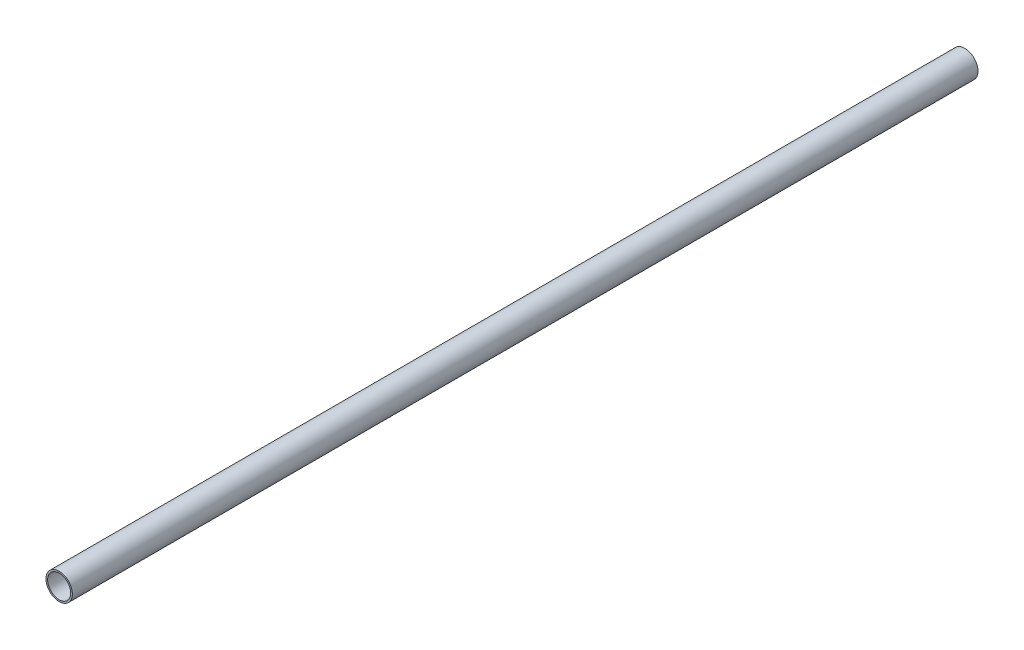
ISO-10303-21;
HEADER;
FILE_DESCRIPTION(('STEP AP214'),'2;1');
FILE_NAME('part.step','',(''),(''),'','','');
FILE_SCHEMA(('AUTOMOTIVE_DESIGN { 1 0 10303 214 1 1 1 1 }'));
ENDSEC;
DATA;
#1=APPLICATION_CONTEXT('core data for automotive mechanical design processes');
#2=APPLICATION_PROTOCOL_DEFINITION('international standard','automotive_design',2000,#1);
#3=PRODUCT_CONTEXT('',#1,'mechanical');
#4=PRODUCT('Part','Part','',(#3));
#5=PRODUCT_RELATED_PRODUCT_CATEGORY('part','',(#4));
#6=PRODUCT_DEFINITION_FORMATION('','',#4);
#7=PRODUCT_DEFINITION_CONTEXT('part definition',#1,'design');
#8=PRODUCT_DEFINITION('design','',#6,#7);
#9=PRODUCT_DEFINITION_SHAPE('','',#8);
#10=(LENGTH_UNIT() NAMED_UNIT(*) SI_UNIT(.MILLI.,.METRE.));
#11=(NAMED_UNIT(*) PLANE_ANGLE_UNIT() SI_UNIT($,.RADIAN.));
#12=(NAMED_UNIT(*) SI_UNIT($,.STERADIAN.) SOLID_ANGLE_UNIT());
#13=UNCERTAINTY_MEASURE_WITH_UNIT(LENGTH_MEASURE(1.E-05),#10,'distance_accuracy_value','');
#14=(GEOMETRIC_REPRESENTATION_CONTEXT(3) GLOBAL_UNCERTAINTY_ASSIGNED_CONTEXT((#13)) GLOBAL_UNIT_ASSIGNED_CONTEXT((#10,
#11,#12)) REPRESENTATION_CONTEXT('',''));
#15=CARTESIAN_POINT('',(0.,0.,0.));
#16=DIRECTION('',(0.,0.,1.));
#17=DIRECTION('',(1.,0.,0.));
#18=AXIS2_PLACEMENT_3D('',#15,#16,#17);
#19=CARTESIAN_POINT('',(0.,0.,550.));
#20=DIRECTION('',(0.,0.,1.));
#21=DIRECTION('',(1.,0.,0.));
#22=AXIS2_PLACEMENT_3D('',#19,#20,#21);
#23=PLANE('',#22);
#24=CARTESIAN_POINT('',(0.,0.,550.));
#25=DIRECTION('',(0.,0.,1.));
#26=DIRECTION('',(1.,0.,0.));
#27=AXIS2_PLACEMENT_3D('',#24,#25,#26);
#28=CIRCLE('',#27,8.);
#29=CARTESIAN_POINT('',(8.,0.,550.));
#30=VERTEX_POINT('',#29);
#31=EDGE_CURVE('E10',#30,#30,#28,.T.);
#32=ORIENTED_EDGE('',*,*,#31,.T.);
#33=EDGE_LOOP('',(#32));
#34=FACE_BOUND('',#33,.T.);
#35=CARTESIAN_POINT('',(0.,0.,550.));
#36=DIRECTION('',(0.,0.,1.));
#37=DIRECTION('',(1.,0.,0.));
#38=AXIS2_PLACEMENT_3D('',#35,#36,#37);
#39=CIRCLE('',#38,7.);
#40=CARTESIAN_POINT('',(7.,0.,550.));
#41=VERTEX_POINT('',#40);
#42=EDGE_CURVE('E48',#41,#41,#39,.T.);
#43=ORIENTED_EDGE('',*,*,#42,.F.);
#44=EDGE_LOOP('',(#43));
#45=FACE_BOUND('',#44,.T.);
#46=ADVANCED_FACE('F37',(#34,#45),#23,.T.);
#47=CARTESIAN_POINT('',(0.,0.,0.));
#48=DIRECTION('',(0.,0.,1.));
#49=DIRECTION('',(1.,0.,0.));
#50=AXIS2_PLACEMENT_3D('',#47,#48,#49);
#51=PLANE('',#50);
#52=CARTESIAN_POINT('',(0.,0.,0.));
#53=DIRECTION('',(0.,0.,1.));
#54=DIRECTION('',(1.,0.,0.));
#55=AXIS2_PLACEMENT_3D('',#52,#53,#54);
#56=CIRCLE('',#55,8.);
#57=CARTESIAN_POINT('',(8.,0.,0.));
#58=VERTEX_POINT('',#57);
#59=EDGE_CURVE('E41',#58,#58,#56,.T.);
#60=ORIENTED_EDGE('',*,*,#59,.F.);
#61=EDGE_LOOP('',(#60));
#62=FACE_BOUND('',#61,.T.);
#63=CARTESIAN_POINT('',(0.,0.,0.));
#64=DIRECTION('',(0.,0.,1.));
#65=DIRECTION('',(1.,0.,0.));
#66=AXIS2_PLACEMENT_3D('',#63,#64,#65);
#67=CIRCLE('',#66,7.);
#68=CARTESIAN_POINT('',(7.,0.,0.));
#69=VERTEX_POINT('',#68);
#70=EDGE_CURVE('E50',#69,#69,#67,.T.);
#71=ORIENTED_EDGE('',*,*,#70,.T.);
#72=EDGE_LOOP('',(#71));
#73=FACE_BOUND('',#72,.T.);
#74=ADVANCED_FACE('F60',(#62,#73),#51,.F.);
#75=CARTESIAN_POINT('',(0.,0.,550.));
#76=DIRECTION('',(0.,0.,-1.));
#77=DIRECTION('',(-1.,0.,0.));
#78=AXIS2_PLACEMENT_3D('',#75,#76,#77);
#79=CYLINDRICAL_SURFACE('',#78,8.);
#80=ORIENTED_EDGE('',*,*,#31,.F.);
#81=EDGE_LOOP('',(#80));
#82=FACE_BOUND('',#81,.T.);
#83=ORIENTED_EDGE('',*,*,#59,.T.);
#84=EDGE_LOOP('',(#83));
#85=FACE_BOUND('',#84,.T.);
#86=ADVANCED_FACE('F39',(#82,#85),#79,.T.);
#87=CARTESIAN_POINT('',(0.,0.,550.));
#88=DIRECTION('',(0.,0.,-1.));
#89=DIRECTION('',(-1.,0.,0.));
#90=AXIS2_PLACEMENT_3D('',#87,#88,#89);
#91=CYLINDRICAL_SURFACE('',#90,7.);
#92=ORIENTED_EDGE('',*,*,#42,.T.);
#93=EDGE_LOOP('',(#92));
#94=FACE_BOUND('',#93,.T.);
#95=ORIENTED_EDGE('',*,*,#70,.F.);
#96=EDGE_LOOP('',(#95));
#97=FACE_BOUND('',#96,.T.);
#98=ADVANCED_FACE('F56',(#94,#97),#91,.F.);
#99=CLOSED_SHELL('',(#46,#74,#86,#98));
#100=MANIFOLD_SOLID_BREP('B2',#99);
#101=ADVANCED_BREP_SHAPE_REPRESENTATION('',(#18,#100),#14);
#102=SHAPE_DEFINITION_REPRESENTATION(#9,#101);
ENDSEC;
END-ISO-10303-21;
